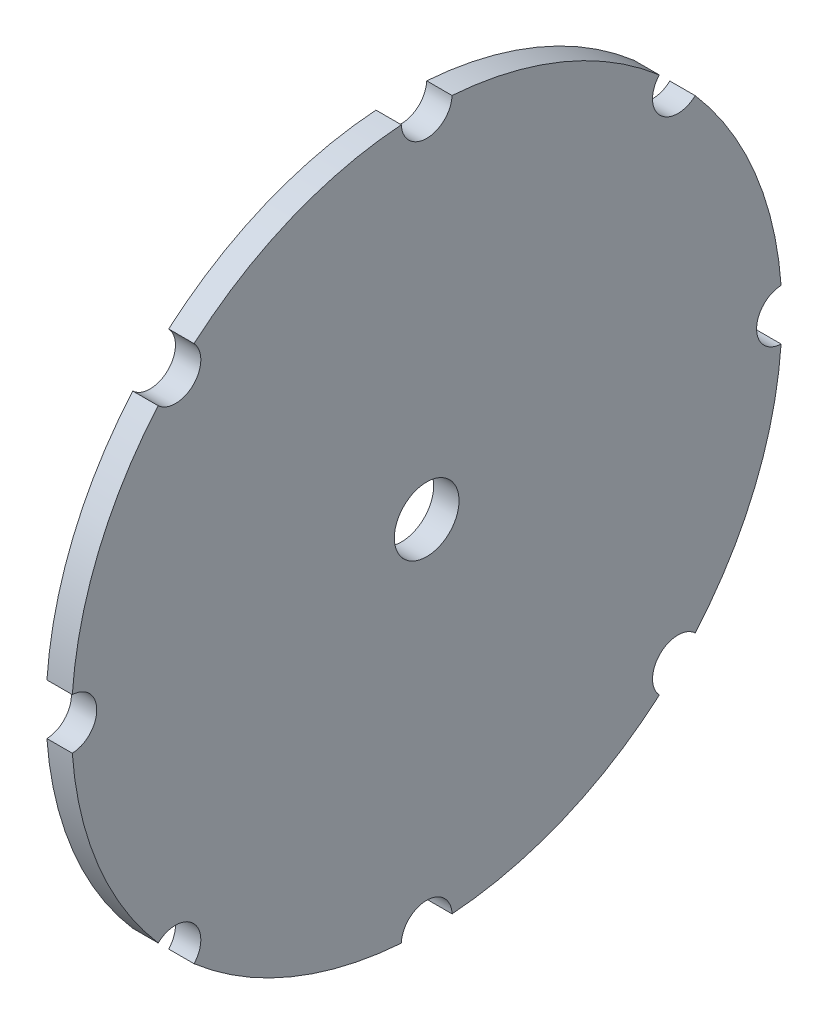
ISO-10303-21;
HEADER;
FILE_DESCRIPTION(('STEP AP214'),'2;1');
FILE_NAME('part.step','',(''),(''),'','','');
FILE_SCHEMA(('AUTOMOTIVE_DESIGN { 1 0 10303 214 1 1 1 1 }'));
ENDSEC;
DATA;
#1=APPLICATION_CONTEXT('core data for automotive mechanical design processes');
#2=APPLICATION_PROTOCOL_DEFINITION('international standard','automotive_design',2000,#1);
#3=PRODUCT_CONTEXT('',#1,'mechanical');
#4=PRODUCT('Part','Part','',(#3));
#5=PRODUCT_RELATED_PRODUCT_CATEGORY('part','',(#4));
#6=PRODUCT_DEFINITION_FORMATION('','',#4);
#7=PRODUCT_DEFINITION_CONTEXT('part definition',#1,'design');
#8=PRODUCT_DEFINITION('design','',#6,#7);
#9=PRODUCT_DEFINITION_SHAPE('','',#8);
#10=(LENGTH_UNIT() NAMED_UNIT(*) SI_UNIT(.MILLI.,.METRE.));
#11=(NAMED_UNIT(*) PLANE_ANGLE_UNIT() SI_UNIT($,.RADIAN.));
#12=(NAMED_UNIT(*) SI_UNIT($,.STERADIAN.) SOLID_ANGLE_UNIT());
#13=UNCERTAINTY_MEASURE_WITH_UNIT(LENGTH_MEASURE(1.E-05),#10,'distance_accuracy_value','');
#14=(GEOMETRIC_REPRESENTATION_CONTEXT(3) GLOBAL_UNCERTAINTY_ASSIGNED_CONTEXT((#13)) GLOBAL_UNIT_ASSIGNED_CONTEXT((#10,
#11,#12)) REPRESENTATION_CONTEXT('',''));
#15=CARTESIAN_POINT('',(0.,0.,0.));
#16=DIRECTION('',(0.,0.,1.));
#17=DIRECTION('',(1.,0.,0.));
#18=AXIS2_PLACEMENT_3D('',#15,#16,#17);
#19=CARTESIAN_POINT('',(-225.,0.,0.));
#20=DIRECTION('',(-1.,0.,0.));
#21=DIRECTION('',(0.,0.,1.));
#22=AXIS2_PLACEMENT_3D('',#19,#20,#21);
#23=CYLINDRICAL_SURFACE('',#22,140.);
#24=DIRECTION('',(-1.,0.,0.));
#25=VECTOR('',#24,1.);
#26=CARTESIAN_POINT('',(-230.,-139.642857142857,9.99362041402377));
#27=LINE('',#26,#25);
#28=CARTESIAN_POINT('',(-225.,-139.642857142857,9.99362041402377));
#29=VERTEX_POINT('',#28);
#30=CARTESIAN_POINT('',(-235.,-139.642857142857,9.99362041402382));
#31=VERTEX_POINT('',#30);
#32=EDGE_CURVE('E64',#29,#31,#27,.T.);
#33=ORIENTED_EDGE('',*,*,#32,.F.);
#34=CARTESIAN_POINT('',(-225.,0.,0.));
#35=DIRECTION('',(-1.,0.,0.));
#36=DIRECTION('',(0.,0.,1.));
#37=AXIS2_PLACEMENT_3D('',#34,#35,#36);
#38=CIRCLE('',#37,140.);
#39=CARTESIAN_POINT('',(-225.,-105.80896799334,91.6758544666175));
#40=VERTEX_POINT('',#39);
#41=EDGE_CURVE('E190',#29,#40,#38,.T.);
#42=ORIENTED_EDGE('',*,*,#41,.T.);
#43=DIRECTION('',(-1.,0.,0.));
#44=VECTOR('',#43,1.);
#45=CARTESIAN_POINT('',(-230.,-105.80896799334,91.6758544666175));
#46=LINE('',#45,#44);
#47=CARTESIAN_POINT('',(-235.,-105.80896799334,91.6758544666175));
#48=VERTEX_POINT('',#47);
#49=EDGE_CURVE('E267',#48,#40,#46,.F.);
#50=ORIENTED_EDGE('',*,*,#49,.F.);
#51=CARTESIAN_POINT('',(-235.,0.,0.));
#52=DIRECTION('',(-1.,0.,0.));
#53=DIRECTION('',(0.,0.,1.));
#54=AXIS2_PLACEMENT_3D('',#51,#52,#53);
#55=CIRCLE('',#54,140.);
#56=EDGE_CURVE('E239',#31,#48,#55,.T.);
#57=ORIENTED_EDGE('',*,*,#56,.F.);
#58=EDGE_LOOP('',(#33,#42,#50,#57));
#59=FACE_BOUND('',#58,.T.);
#60=ADVANCED_FACE('F40',(#59),#23,.T.);
#61=DIRECTION('',(-1.,0.,0.));
#62=VECTOR('',#61,1.);
#63=CARTESIAN_POINT('',(-230.,-91.6758544666186,105.808967993339));
#64=LINE('',#63,#62);
#65=CARTESIAN_POINT('',(-225.,-91.6758544666186,105.808967993339));
#66=VERTEX_POINT('',#65);
#67=CARTESIAN_POINT('',(-235.,-91.6758544666186,105.808967993339));
#68=VERTEX_POINT('',#67);
#69=EDGE_CURVE('E56',#66,#68,#64,.T.);
#70=ORIENTED_EDGE('',*,*,#69,.F.);
#71=CARTESIAN_POINT('',(-225.,-9.99362041402435,139.642857142857));
#72=VERTEX_POINT('',#71);
#73=EDGE_CURVE('E197',#66,#72,#38,.T.);
#74=ORIENTED_EDGE('',*,*,#73,.T.);
#75=DIRECTION('',(-1.,0.,0.));
#76=VECTOR('',#75,1.);
#77=CARTESIAN_POINT('',(-230.,-9.99362041402435,139.642857142857));
#78=LINE('',#77,#76);
#79=CARTESIAN_POINT('',(-235.,-9.99362041402435,139.642857142857));
#80=VERTEX_POINT('',#79);
#81=EDGE_CURVE('E273',#80,#72,#78,.F.);
#82=ORIENTED_EDGE('',*,*,#81,.F.);
#83=EDGE_CURVE('E205',#68,#80,#55,.T.);
#84=ORIENTED_EDGE('',*,*,#83,.F.);
#85=EDGE_LOOP('',(#70,#74,#82,#84));
#86=FACE_BOUND('',#85,.T.);
#87=ADVANCED_FACE('F375',(#86),#23,.T.);
#88=DIRECTION('',(-1.,0.,0.));
#89=VECTOR('',#88,1.);
#90=CARTESIAN_POINT('',(-230.,9.99362041402319,139.642857142857));
#91=LINE('',#90,#89);
#92=CARTESIAN_POINT('',(-225.,9.99362041402319,139.642857142857));
#93=VERTEX_POINT('',#92);
#94=CARTESIAN_POINT('',(-235.,9.99362041402324,139.642857142857));
#95=VERTEX_POINT('',#94);
#96=EDGE_CURVE('E270',#93,#95,#91,.T.);
#97=ORIENTED_EDGE('',*,*,#96,.F.);
#98=CARTESIAN_POINT('',(-225.,91.6758544666178,105.808967993339));
#99=VERTEX_POINT('',#98);
#100=EDGE_CURVE('E191',#93,#99,#38,.T.);
#101=ORIENTED_EDGE('',*,*,#100,.T.);
#102=DIRECTION('',(-1.,0.,0.));
#103=VECTOR('',#102,1.);
#104=CARTESIAN_POINT('',(-230.,91.6758544666178,105.808967993339));
#105=LINE('',#104,#103);
#106=CARTESIAN_POINT('',(-235.,91.6758544666178,105.808967993339));
#107=VERTEX_POINT('',#106);
#108=EDGE_CURVE('E292',#107,#99,#105,.F.);
#109=ORIENTED_EDGE('',*,*,#108,.F.);
#110=EDGE_CURVE('E200',#95,#107,#55,.T.);
#111=ORIENTED_EDGE('',*,*,#110,.F.);
#112=EDGE_LOOP('',(#97,#101,#109,#111));
#113=FACE_BOUND('',#112,.T.);
#114=ADVANCED_FACE('F382',(#113),#23,.T.);
#115=DIRECTION('',(-1.,0.,0.));
#116=VECTOR('',#115,1.);
#117=CARTESIAN_POINT('',(-230.,139.642857142857,-9.99362041402377));
#118=LINE('',#117,#116);
#119=CARTESIAN_POINT('',(-225.,139.642857142857,-9.99362041402377));
#120=VERTEX_POINT('',#119);
#121=CARTESIAN_POINT('',(-235.,139.642857142857,-9.99362041402382));
#122=VERTEX_POINT('',#121);
#123=EDGE_CURVE('E276',#120,#122,#118,.T.);
#124=ORIENTED_EDGE('',*,*,#123,.F.);
#125=CARTESIAN_POINT('',(-225.,105.80896799334,-91.6758544666168));
#126=VERTEX_POINT('',#125);
#127=EDGE_CURVE('E188',#120,#126,#38,.T.);
#128=ORIENTED_EDGE('',*,*,#127,.T.);
#129=DIRECTION('',(-1.,0.,0.));
#130=VECTOR('',#129,1.);
#131=CARTESIAN_POINT('',(-230.,105.80896799334,-91.6758544666168));
#132=LINE('',#131,#130);
#133=CARTESIAN_POINT('',(-235.,105.80896799334,-91.6758544666168));
#134=VERTEX_POINT('',#133);
#135=EDGE_CURVE('E285',#134,#126,#132,.F.);
#136=ORIENTED_EDGE('',*,*,#135,.F.);
#137=EDGE_CURVE('E230',#122,#134,#55,.T.);
#138=ORIENTED_EDGE('',*,*,#137,.F.);
#139=EDGE_LOOP('',(#124,#128,#136,#138));
#140=FACE_BOUND('',#139,.T.);
#141=ADVANCED_FACE('F344',(#140),#23,.T.);
#142=DIRECTION('',(-1.,0.,0.));
#143=VECTOR('',#142,1.);
#144=CARTESIAN_POINT('',(-230.,91.6758544666193,-105.808967993338));
#145=LINE('',#144,#143);
#146=CARTESIAN_POINT('',(-225.,91.6758544666193,-105.808967993338));
#147=VERTEX_POINT('',#146);
#148=CARTESIAN_POINT('',(-235.,91.6758544666192,-105.808967993338));
#149=VERTEX_POINT('',#148);
#150=EDGE_CURVE('E282',#147,#149,#145,.T.);
#151=ORIENTED_EDGE('',*,*,#150,.F.);
#152=CARTESIAN_POINT('',(-225.,9.99362041402513,-139.642857142857));
#153=VERTEX_POINT('',#152);
#154=EDGE_CURVE('E183',#147,#153,#38,.T.);
#155=ORIENTED_EDGE('',*,*,#154,.T.);
#156=DIRECTION('',(-1.,0.,0.));
#157=VECTOR('',#156,1.);
#158=CARTESIAN_POINT('',(-230.,9.99362041402513,-139.642857142857));
#159=LINE('',#158,#157);
#160=CARTESIAN_POINT('',(-235.,9.99362041402513,-139.642857142857));
#161=VERTEX_POINT('',#160);
#162=EDGE_CURVE('E214',#161,#153,#159,.F.);
#163=ORIENTED_EDGE('',*,*,#162,.F.);
#164=EDGE_CURVE('E221',#149,#161,#55,.T.);
#165=ORIENTED_EDGE('',*,*,#164,.F.);
#166=EDGE_LOOP('',(#151,#155,#163,#165));
#167=FACE_BOUND('',#166,.T.);
#168=ADVANCED_FACE('F220',(#167),#23,.T.);
#169=DIRECTION('',(-1.,0.,0.));
#170=VECTOR('',#169,1.);
#171=CARTESIAN_POINT('',(-230.,-9.99362041402241,-139.642857142857));
#172=LINE('',#171,#170);
#173=CARTESIAN_POINT('',(-225.,-9.99362041402241,-139.642857142857));
#174=VERTEX_POINT('',#173);
#175=CARTESIAN_POINT('',(-235.,-9.99362041402246,-139.642857142857));
#176=VERTEX_POINT('',#175);
#177=EDGE_CURVE('E181',#174,#176,#172,.T.);
#178=ORIENTED_EDGE('',*,*,#177,.F.);
#179=CARTESIAN_POINT('',(-225.,-91.6758544666172,-105.80896799334));
#180=VERTEX_POINT('',#179);
#181=EDGE_CURVE('E172',#174,#180,#38,.T.);
#182=ORIENTED_EDGE('',*,*,#181,.T.);
#183=DIRECTION('',(-1.,0.,0.));
#184=VECTOR('',#183,1.);
#185=CARTESIAN_POINT('',(-230.,-91.6758544666172,-105.80896799334));
#186=LINE('',#185,#184);
#187=CARTESIAN_POINT('',(-235.,-91.6758544666172,-105.80896799334));
#188=VERTEX_POINT('',#187);
#189=EDGE_CURVE('E152',#188,#180,#186,.F.);
#190=ORIENTED_EDGE('',*,*,#189,.F.);
#191=EDGE_CURVE('E231',#176,#188,#55,.T.);
#192=ORIENTED_EDGE('',*,*,#191,.F.);
#193=EDGE_LOOP('',(#178,#182,#190,#192));
#194=FACE_BOUND('',#193,.T.);
#195=ADVANCED_FACE('F180',(#194),#23,.T.);
#196=DIRECTION('',(-1.,0.,0.));
#197=VECTOR('',#196,1.);
#198=CARTESIAN_POINT('',(-230.,139.642857142857,9.99362041402377));
#199=LINE('',#198,#197);
#200=CARTESIAN_POINT('',(-235.,139.642857142857,9.99362041402377));
#201=VERTEX_POINT('',#200);
#202=CARTESIAN_POINT('',(-225.,139.642857142857,9.99362041402377));
#203=VERTEX_POINT('',#202);
#204=EDGE_CURVE('E279',#201,#203,#199,.F.);
#205=ORIENTED_EDGE('',*,*,#204,.F.);
#206=CARTESIAN_POINT('',(-235.,105.808967993339,91.6758544666182));
#207=VERTEX_POINT('',#206);
#208=EDGE_CURVE('E204',#207,#201,#55,.T.);
#209=ORIENTED_EDGE('',*,*,#208,.F.);
#210=DIRECTION('',(-1.,0.,0.));
#211=VECTOR('',#210,1.);
#212=CARTESIAN_POINT('',(-230.,105.808967993339,91.6758544666183));
#213=LINE('',#212,#211);
#214=CARTESIAN_POINT('',(-225.,105.808967993339,91.6758544666183));
#215=VERTEX_POINT('',#214);
#216=EDGE_CURVE('E223',#215,#207,#213,.T.);
#217=ORIENTED_EDGE('',*,*,#216,.F.);
#218=EDGE_CURVE('E196',#215,#203,#38,.T.);
#219=ORIENTED_EDGE('',*,*,#218,.T.);
#220=EDGE_LOOP('',(#205,#209,#217,#219));
#221=FACE_BOUND('',#220,.T.);
#222=ADVANCED_FACE('F355',(#221),#23,.T.);
#223=DIRECTION('',(-1.,0.,0.));
#224=VECTOR('',#223,1.);
#225=CARTESIAN_POINT('',(-230.,-139.642857142857,-9.99362041402377));
#226=LINE('',#225,#224);
#227=CARTESIAN_POINT('',(-235.,-139.642857142857,-9.99362041402377));
#228=VERTEX_POINT('',#227);
#229=CARTESIAN_POINT('',(-225.,-139.642857142857,-9.99362041402377));
#230=VERTEX_POINT('',#229);
#231=EDGE_CURVE('E262',#228,#230,#226,.F.);
#232=ORIENTED_EDGE('',*,*,#231,.F.);
#233=CARTESIAN_POINT('',(-235.,-105.808967993338,-91.6758544666189));
#234=VERTEX_POINT('',#233);
#235=EDGE_CURVE('E235',#234,#228,#55,.T.);
#236=ORIENTED_EDGE('',*,*,#235,.F.);
#237=DIRECTION('',(-1.,0.,0.));
#238=VECTOR('',#237,1.);
#239=CARTESIAN_POINT('',(-230.,-105.808967993338,-91.675854466619));
#240=LINE('',#239,#238);
#241=CARTESIAN_POINT('',(-225.,-105.808967993338,-91.675854466619));
#242=VERTEX_POINT('',#241);
#243=EDGE_CURVE('E164',#242,#234,#240,.T.);
#244=ORIENTED_EDGE('',*,*,#243,.F.);
#245=EDGE_CURVE('E175',#242,#230,#38,.T.);
#246=ORIENTED_EDGE('',*,*,#245,.T.);
#247=EDGE_LOOP('',(#232,#236,#244,#246));
#248=FACE_BOUND('',#247,.T.);
#249=ADVANCED_FACE('F42',(#248),#23,.T.);
#250=CARTESIAN_POINT('',(-225.,0.,0.));
#251=DIRECTION('',(-1.,0.,0.));
#252=DIRECTION('',(0.,0.,1.));
#253=AXIS2_PLACEMENT_3D('',#250,#251,#252);
#254=PLANE('',#253);
#255=CARTESIAN_POINT('',(-225.,0.,0.));
#256=DIRECTION('',(-1.,0.,0.));
#257=DIRECTION('',(0.,0.,1.));
#258=AXIS2_PLACEMENT_3D('',#255,#256,#257);
#259=CIRCLE('',#258,12.75);
#260=CARTESIAN_POINT('',(-225.,0.,12.75));
#261=VERTEX_POINT('',#260);
#262=EDGE_CURVE('E248',#261,#261,#259,.T.);
#263=ORIENTED_EDGE('',*,*,#262,.T.);
#264=EDGE_LOOP('',(#263));
#265=FACE_BOUND('',#264,.T.);
#266=ORIENTED_EDGE('',*,*,#41,.F.);
#267=CARTESIAN_POINT('',(-225.,-140.,0.));
#268=DIRECTION('',(-1.,0.,0.));
#269=DIRECTION('',(0.,0.,1.));
#270=AXIS2_PLACEMENT_3D('',#267,#268,#269);
#271=CIRCLE('',#270,10.);
#272=EDGE_CURVE('E177',#29,#230,#271,.T.);
#273=ORIENTED_EDGE('',*,*,#272,.T.);
#274=ORIENTED_EDGE('',*,*,#245,.F.);
#275=CARTESIAN_POINT('',(-225.,-98.9949493661159,-98.9949493661175));
#276=DIRECTION('',(-1.,0.,0.));
#277=DIRECTION('',(0.,0.,1.));
#278=AXIS2_PLACEMENT_3D('',#275,#276,#277);
#279=CIRCLE('',#278,10.0000000000001);
#280=EDGE_CURVE('E155',#242,#180,#279,.T.);
#281=ORIENTED_EDGE('',*,*,#280,.T.);
#282=ORIENTED_EDGE('',*,*,#181,.F.);
#283=CARTESIAN_POINT('',(-225.,1.38777878078145E-12,-140.));
#284=DIRECTION('',(-1.,0.,0.));
#285=DIRECTION('',(0.,0.,1.));
#286=AXIS2_PLACEMENT_3D('',#283,#284,#285);
#287=CIRCLE('',#286,10.);
#288=EDGE_CURVE('E331',#174,#153,#287,.T.);
#289=ORIENTED_EDGE('',*,*,#288,.T.);
#290=ORIENTED_EDGE('',*,*,#154,.F.);
#291=CARTESIAN_POINT('',(-225.,98.9949493661178,-98.9949493661154));
#292=DIRECTION('',(-1.,0.,0.));
#293=DIRECTION('',(0.,0.,1.));
#294=AXIS2_PLACEMENT_3D('',#291,#292,#293);
#295=CIRCLE('',#294,10.);
#296=EDGE_CURVE('E301',#147,#126,#295,.T.);
#297=ORIENTED_EDGE('',*,*,#296,.T.);
#298=ORIENTED_EDGE('',*,*,#127,.F.);
#299=CARTESIAN_POINT('',(-225.,140.,0.));
#300=DIRECTION('',(-1.,0.,0.));
#301=DIRECTION('',(0.,0.,1.));
#302=AXIS2_PLACEMENT_3D('',#299,#300,#301);
#303=CIRCLE('',#302,10.);
#304=EDGE_CURVE('E300',#120,#203,#303,.T.);
#305=ORIENTED_EDGE('',*,*,#304,.T.);
#306=ORIENTED_EDGE('',*,*,#218,.F.);
#307=CARTESIAN_POINT('',(-225.,98.9949493661164,98.9949493661168));
#308=DIRECTION('',(-1.,0.,0.));
#309=DIRECTION('',(0.,0.,1.));
#310=AXIS2_PLACEMENT_3D('',#307,#308,#309);
#311=CIRCLE('',#310,10.);
#312=EDGE_CURVE('E327',#215,#99,#311,.T.);
#313=ORIENTED_EDGE('',*,*,#312,.T.);
#314=ORIENTED_EDGE('',*,*,#100,.F.);
#315=CARTESIAN_POINT('',(-225.,-5.55111512312578E-13,140.));
#316=DIRECTION('',(-1.,0.,0.));
#317=DIRECTION('',(0.,0.,1.));
#318=AXIS2_PLACEMENT_3D('',#315,#316,#317);
#319=CIRCLE('',#318,10.);
#320=EDGE_CURVE('E308',#93,#72,#319,.T.);
#321=ORIENTED_EDGE('',*,*,#320,.T.);
#322=ORIENTED_EDGE('',*,*,#73,.F.);
#323=CARTESIAN_POINT('',(-225.,-98.9949493661172,98.9949493661161));
#324=DIRECTION('',(-1.,0.,0.));
#325=DIRECTION('',(0.,0.,1.));
#326=AXIS2_PLACEMENT_3D('',#323,#324,#325);
#327=CIRCLE('',#326,10.);
#328=EDGE_CURVE('E315',#66,#40,#327,.T.);
#329=ORIENTED_EDGE('',*,*,#328,.T.);
#330=EDGE_LOOP('',(#266,#273,#274,#281,#282,#289,#290,#297,#298,#305,#306,#313,#314,#321,#322,#329));
#331=FACE_BOUND('',#330,.T.);
#332=ADVANCED_FACE('F170',(#265,#331),#254,.F.);
#333=CARTESIAN_POINT('',(-235.,0.,0.));
#334=DIRECTION('',(-1.,0.,0.));
#335=DIRECTION('',(0.,0.,1.));
#336=AXIS2_PLACEMENT_3D('',#333,#334,#335);
#337=PLANE('',#336);
#338=CARTESIAN_POINT('',(-235.,-140.,0.));
#339=DIRECTION('',(-1.,0.,0.));
#340=DIRECTION('',(0.,0.,1.));
#341=AXIS2_PLACEMENT_3D('',#338,#339,#340);
#342=CIRCLE('',#341,10.);
#343=EDGE_CURVE('E319',#31,#228,#342,.T.);
#344=ORIENTED_EDGE('',*,*,#343,.F.);
#345=ORIENTED_EDGE('',*,*,#56,.T.);
#346=CARTESIAN_POINT('',(-235.,-98.9949493661172,98.9949493661161));
#347=DIRECTION('',(-1.,0.,0.));
#348=DIRECTION('',(0.,0.,1.));
#349=AXIS2_PLACEMENT_3D('',#346,#347,#348);
#350=CIRCLE('',#349,10.);
#351=EDGE_CURVE('E312',#68,#48,#350,.T.);
#352=ORIENTED_EDGE('',*,*,#351,.F.);
#353=ORIENTED_EDGE('',*,*,#83,.T.);
#354=CARTESIAN_POINT('',(-235.,-5.55111512312578E-13,140.));
#355=DIRECTION('',(-1.,0.,0.));
#356=DIRECTION('',(0.,0.,1.));
#357=AXIS2_PLACEMENT_3D('',#354,#355,#356);
#358=CIRCLE('',#357,10.);
#359=EDGE_CURVE('E305',#95,#80,#358,.T.);
#360=ORIENTED_EDGE('',*,*,#359,.F.);
#361=ORIENTED_EDGE('',*,*,#110,.T.);
#362=CARTESIAN_POINT('',(-235.,98.9949493661164,98.9949493661168));
#363=DIRECTION('',(-1.,0.,0.));
#364=DIRECTION('',(0.,0.,1.));
#365=AXIS2_PLACEMENT_3D('',#362,#363,#364);
#366=CIRCLE('',#365,10.);
#367=EDGE_CURVE('E324',#207,#107,#366,.T.);
#368=ORIENTED_EDGE('',*,*,#367,.F.);
#369=ORIENTED_EDGE('',*,*,#208,.T.);
#370=CARTESIAN_POINT('',(-235.,140.,0.));
#371=DIRECTION('',(-1.,0.,0.));
#372=DIRECTION('',(0.,0.,1.));
#373=AXIS2_PLACEMENT_3D('',#370,#371,#372);
#374=CIRCLE('',#373,10.);
#375=EDGE_CURVE('E297',#122,#201,#374,.T.);
#376=ORIENTED_EDGE('',*,*,#375,.F.);
#377=ORIENTED_EDGE('',*,*,#137,.T.);
#378=CARTESIAN_POINT('',(-235.,98.9949493661178,-98.9949493661154));
#379=DIRECTION('',(-1.,0.,0.));
#380=DIRECTION('',(0.,0.,1.));
#381=AXIS2_PLACEMENT_3D('',#378,#379,#380);
#382=CIRCLE('',#381,10.);
#383=EDGE_CURVE('E11',#149,#134,#382,.T.);
#384=ORIENTED_EDGE('',*,*,#383,.F.);
#385=ORIENTED_EDGE('',*,*,#164,.T.);
#386=CARTESIAN_POINT('',(-235.,1.38777878078145E-12,-140.));
#387=DIRECTION('',(-1.,0.,0.));
#388=DIRECTION('',(0.,0.,1.));
#389=AXIS2_PLACEMENT_3D('',#386,#387,#388);
#390=CIRCLE('',#389,10.);
#391=EDGE_CURVE('E49',#176,#161,#390,.T.);
#392=ORIENTED_EDGE('',*,*,#391,.F.);
#393=ORIENTED_EDGE('',*,*,#191,.T.);
#394=CARTESIAN_POINT('',(-235.,-98.9949493661159,-98.9949493661175));
#395=DIRECTION('',(-1.,0.,0.));
#396=DIRECTION('',(0.,0.,1.));
#397=AXIS2_PLACEMENT_3D('',#394,#395,#396);
#398=CIRCLE('',#397,10.0000000000001);
#399=EDGE_CURVE('E158',#234,#188,#398,.T.);
#400=ORIENTED_EDGE('',*,*,#399,.F.);
#401=ORIENTED_EDGE('',*,*,#235,.T.);
#402=EDGE_LOOP('',(#344,#345,#352,#353,#360,#361,#368,#369,#376,#377,#384,#385,#392,#393,#400,#401));
#403=FACE_BOUND('',#402,.T.);
#404=CARTESIAN_POINT('',(-235.,0.,0.));
#405=DIRECTION('',(-1.,0.,0.));
#406=DIRECTION('',(0.,0.,1.));
#407=AXIS2_PLACEMENT_3D('',#404,#405,#406);
#408=CIRCLE('',#407,12.75);
#409=CARTESIAN_POINT('',(-235.,0.,12.75));
#410=VERTEX_POINT('',#409);
#411=EDGE_CURVE('E198',#410,#410,#408,.T.);
#412=ORIENTED_EDGE('',*,*,#411,.F.);
#413=EDGE_LOOP('',(#412));
#414=FACE_BOUND('',#413,.T.);
#415=ADVANCED_FACE('F226',(#403,#414),#337,.T.);
#416=CARTESIAN_POINT('',(-225.,0.,0.));
#417=DIRECTION('',(-1.,0.,0.));
#418=DIRECTION('',(0.,0.,1.));
#419=AXIS2_PLACEMENT_3D('',#416,#417,#418);
#420=CYLINDRICAL_SURFACE('',#419,12.75);
#421=ORIENTED_EDGE('',*,*,#262,.F.);
#422=EDGE_LOOP('',(#421));
#423=FACE_BOUND('',#422,.T.);
#424=ORIENTED_EDGE('',*,*,#411,.T.);
#425=EDGE_LOOP('',(#424));
#426=FACE_BOUND('',#425,.T.);
#427=ADVANCED_FACE('F394',(#423,#426),#420,.F.);
#428=CARTESIAN_POINT('',(-225.,-98.9949493661159,-98.9949493661175));
#429=DIRECTION('',(-1.,0.,0.));
#430=DIRECTION('',(0.,0.,1.));
#431=AXIS2_PLACEMENT_3D('',#428,#429,#430);
#432=CYLINDRICAL_SURFACE('',#431,10.0000000000001);
#433=ORIENTED_EDGE('',*,*,#243,.T.);
#434=ORIENTED_EDGE('',*,*,#399,.T.);
#435=ORIENTED_EDGE('',*,*,#189,.T.);
#436=ORIENTED_EDGE('',*,*,#280,.F.);
#437=EDGE_LOOP('',(#433,#434,#435,#436));
#438=FACE_BOUND('',#437,.T.);
#439=ADVANCED_FACE('F154',(#438),#432,.F.);
#440=CARTESIAN_POINT('',(-225.,98.9949493661164,98.9949493661168));
#441=DIRECTION('',(-1.,0.,0.));
#442=DIRECTION('',(0.,0.,1.));
#443=AXIS2_PLACEMENT_3D('',#440,#441,#442);
#444=CYLINDRICAL_SURFACE('',#443,10.);
#445=ORIENTED_EDGE('',*,*,#216,.T.);
#446=ORIENTED_EDGE('',*,*,#367,.T.);
#447=ORIENTED_EDGE('',*,*,#108,.T.);
#448=ORIENTED_EDGE('',*,*,#312,.F.);
#449=EDGE_LOOP('',(#445,#446,#447,#448));
#450=FACE_BOUND('',#449,.T.);
#451=ADVANCED_FACE('F385',(#450),#444,.F.);
#452=CARTESIAN_POINT('',(-225.,1.38777878078145E-12,-140.));
#453=DIRECTION('',(-1.,0.,0.));
#454=DIRECTION('',(0.,0.,1.));
#455=AXIS2_PLACEMENT_3D('',#452,#453,#454);
#456=CYLINDRICAL_SURFACE('',#455,10.);
#457=ORIENTED_EDGE('',*,*,#177,.T.);
#458=ORIENTED_EDGE('',*,*,#391,.T.);
#459=ORIENTED_EDGE('',*,*,#162,.T.);
#460=ORIENTED_EDGE('',*,*,#288,.F.);
#461=EDGE_LOOP('',(#457,#458,#459,#460));
#462=FACE_BOUND('',#461,.T.);
#463=ADVANCED_FACE('F213',(#462),#456,.F.);
#464=CARTESIAN_POINT('',(-225.,98.9949493661178,-98.9949493661154));
#465=DIRECTION('',(-1.,0.,0.));
#466=DIRECTION('',(0.,0.,1.));
#467=AXIS2_PLACEMENT_3D('',#464,#465,#466);
#468=CYLINDRICAL_SURFACE('',#467,10.);
#469=ORIENTED_EDGE('',*,*,#150,.T.);
#470=ORIENTED_EDGE('',*,*,#383,.T.);
#471=ORIENTED_EDGE('',*,*,#135,.T.);
#472=ORIENTED_EDGE('',*,*,#296,.F.);
#473=EDGE_LOOP('',(#469,#470,#471,#472));
#474=FACE_BOUND('',#473,.T.);
#475=ADVANCED_FACE('F392',(#474),#468,.F.);
#476=CARTESIAN_POINT('',(-225.,140.,0.));
#477=DIRECTION('',(-1.,0.,0.));
#478=DIRECTION('',(0.,0.,1.));
#479=AXIS2_PLACEMENT_3D('',#476,#477,#478);
#480=CYLINDRICAL_SURFACE('',#479,10.);
#481=ORIENTED_EDGE('',*,*,#123,.T.);
#482=ORIENTED_EDGE('',*,*,#375,.T.);
#483=ORIENTED_EDGE('',*,*,#204,.T.);
#484=ORIENTED_EDGE('',*,*,#304,.F.);
#485=EDGE_LOOP('',(#481,#482,#483,#484));
#486=FACE_BOUND('',#485,.T.);
#487=ADVANCED_FACE('F360',(#486),#480,.F.);
#488=CARTESIAN_POINT('',(-225.,-5.55111512312578E-13,140.));
#489=DIRECTION('',(-1.,0.,0.));
#490=DIRECTION('',(0.,0.,1.));
#491=AXIS2_PLACEMENT_3D('',#488,#489,#490);
#492=CYLINDRICAL_SURFACE('',#491,10.);
#493=ORIENTED_EDGE('',*,*,#96,.T.);
#494=ORIENTED_EDGE('',*,*,#359,.T.);
#495=ORIENTED_EDGE('',*,*,#81,.T.);
#496=ORIENTED_EDGE('',*,*,#320,.F.);
#497=EDGE_LOOP('',(#493,#494,#495,#496));
#498=FACE_BOUND('',#497,.T.);
#499=ADVANCED_FACE('F378',(#498),#492,.F.);
#500=CARTESIAN_POINT('',(-225.,-98.9949493661172,98.9949493661161));
#501=DIRECTION('',(-1.,0.,0.));
#502=DIRECTION('',(0.,0.,1.));
#503=AXIS2_PLACEMENT_3D('',#500,#501,#502);
#504=CYLINDRICAL_SURFACE('',#503,10.);
#505=ORIENTED_EDGE('',*,*,#69,.T.);
#506=ORIENTED_EDGE('',*,*,#351,.T.);
#507=ORIENTED_EDGE('',*,*,#49,.T.);
#508=ORIENTED_EDGE('',*,*,#328,.F.);
#509=EDGE_LOOP('',(#505,#506,#507,#508));
#510=FACE_BOUND('',#509,.T.);
#511=ADVANCED_FACE('F373',(#510),#504,.F.);
#512=CARTESIAN_POINT('',(-225.,-140.,0.));
#513=DIRECTION('',(-1.,0.,0.));
#514=DIRECTION('',(0.,0.,1.));
#515=AXIS2_PLACEMENT_3D('',#512,#513,#514);
#516=CYLINDRICAL_SURFACE('',#515,10.);
#517=ORIENTED_EDGE('',*,*,#32,.T.);
#518=ORIENTED_EDGE('',*,*,#343,.T.);
#519=ORIENTED_EDGE('',*,*,#231,.T.);
#520=ORIENTED_EDGE('',*,*,#272,.F.);
#521=EDGE_LOOP('',(#517,#518,#519,#520));
#522=FACE_BOUND('',#521,.T.);
#523=ADVANCED_FACE('F409',(#522),#516,.F.);
#524=CLOSED_SHELL('',(#60,#87,#114,#141,#168,#195,#222,#249,#332,#415,#427,#439,#451,#463,#475,
#487,#499,#511,#523));
#525=MANIFOLD_SOLID_BREP('B2',#524);
#526=ADVANCED_BREP_SHAPE_REPRESENTATION('',(#18,#525),#14);
#527=SHAPE_DEFINITION_REPRESENTATION(#9,#526);
ENDSEC;
END-ISO-10303-21;
